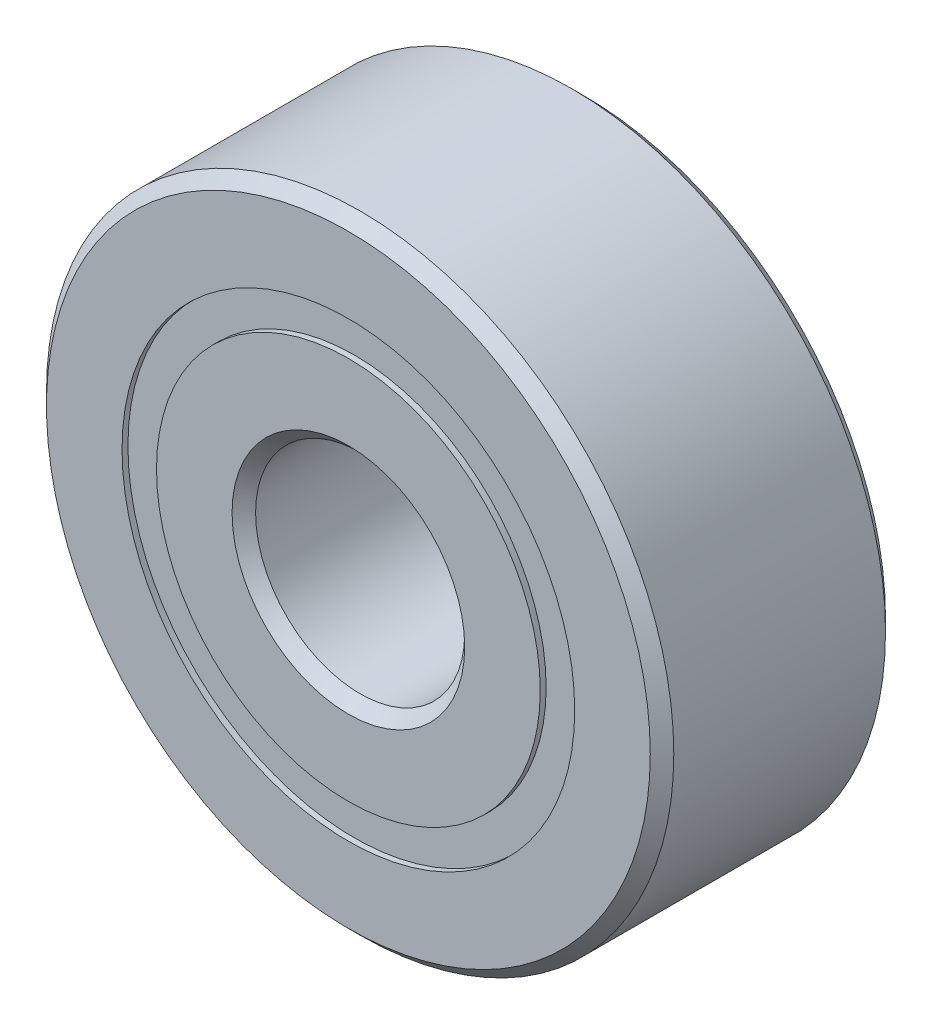
ISO-10303-21;
HEADER;
FILE_DESCRIPTION(('STEP AP214'),'2;1');
FILE_NAME('part.step','',(''),(''),'','','');
FILE_SCHEMA(('AUTOMOTIVE_DESIGN { 1 0 10303 214 1 1 1 1 }'));
ENDSEC;
DATA;
#1=APPLICATION_CONTEXT('core data for automotive mechanical design processes');
#2=APPLICATION_PROTOCOL_DEFINITION('international standard','automotive_design',2000,#1);
#3=PRODUCT_CONTEXT('',#1,'mechanical');
#4=PRODUCT('Part','Part','',(#3));
#5=PRODUCT_RELATED_PRODUCT_CATEGORY('part','',(#4));
#6=PRODUCT_DEFINITION_FORMATION('','',#4);
#7=PRODUCT_DEFINITION_CONTEXT('part definition',#1,'design');
#8=PRODUCT_DEFINITION('design','',#6,#7);
#9=PRODUCT_DEFINITION_SHAPE('','',#8);
#10=(LENGTH_UNIT() NAMED_UNIT(*) SI_UNIT(.MILLI.,.METRE.));
#11=(NAMED_UNIT(*) PLANE_ANGLE_UNIT() SI_UNIT($,.RADIAN.));
#12=(NAMED_UNIT(*) SI_UNIT($,.STERADIAN.) SOLID_ANGLE_UNIT());
#13=UNCERTAINTY_MEASURE_WITH_UNIT(LENGTH_MEASURE(1.E-05),#10,'distance_accuracy_value','');
#14=(GEOMETRIC_REPRESENTATION_CONTEXT(3) GLOBAL_UNCERTAINTY_ASSIGNED_CONTEXT((#13)) GLOBAL_UNIT_ASSIGNED_CONTEXT((#10,
#11,#12)) REPRESENTATION_CONTEXT('',''));
#15=CARTESIAN_POINT('',(0.,0.,0.));
#16=DIRECTION('',(0.,0.,1.));
#17=DIRECTION('',(1.,0.,0.));
#18=AXIS2_PLACEMENT_3D('',#15,#16,#17);
#19=CARTESIAN_POINT('',(0.,6.87335164835165,-3.39328125));
#20=DIRECTION('',(0.,0.,1.));
#21=DIRECTION('',(1.,0.,0.));
#22=AXIS2_PLACEMENT_3D('',#19,#20,#21);
#23=PLANE('',#22);
#24=CARTESIAN_POINT('',(0.,0.,-3.39328125));
#25=DIRECTION('',(0.,0.,1.));
#26=DIRECTION('',(1.,0.,0.));
#27=AXIS2_PLACEMENT_3D('',#24,#25,#26);
#28=CIRCLE('',#27,6.87335164835165);
#29=CARTESIAN_POINT('',(6.87335164835165,0.,-3.39328125));
#30=VERTEX_POINT('',#29);
#31=EDGE_CURVE('E58',#30,#30,#28,.T.);
#32=ORIENTED_EDGE('',*,*,#31,.F.);
#33=EDGE_LOOP('',(#32));
#34=FACE_BOUND('',#33,.T.);
#35=CARTESIAN_POINT('',(0.,0.,-3.39328125));
#36=DIRECTION('',(0.,0.,1.));
#37=DIRECTION('',(1.,0.,0.));
#38=AXIS2_PLACEMENT_3D('',#35,#36,#37);
#39=CIRCLE('',#38,5.82664835164835);
#40=CARTESIAN_POINT('',(5.82664835164835,0.,-3.39328125));
#41=VERTEX_POINT('',#40);
#42=EDGE_CURVE('E11',#41,#41,#39,.T.);
#43=ORIENTED_EDGE('',*,*,#42,.T.);
#44=EDGE_LOOP('',(#43));
#45=FACE_BOUND('',#44,.T.);
#46=ADVANCED_FACE('F44',(#34,#45),#23,.F.);
#47=CARTESIAN_POINT('',(0.,0.,3.571875));
#48=DIRECTION('',(0.,0.,1.));
#49=DIRECTION('',(1.,0.,0.));
#50=AXIS2_PLACEMENT_3D('',#47,#48,#49);
#51=CYLINDRICAL_SURFACE('',#50,5.82664835164835);
#52=ORIENTED_EDGE('',*,*,#42,.F.);
#53=EDGE_LOOP('',(#52));
#54=FACE_BOUND('',#53,.T.);
#55=CARTESIAN_POINT('',(0.,0.,-1.67154216154795));
#56=DIRECTION('',(0.,0.,1.));
#57=DIRECTION('',(1.,0.,0.));
#58=AXIS2_PLACEMENT_3D('',#55,#56,#57);
#59=CIRCLE('',#58,5.82664835164835);
#60=CARTESIAN_POINT('',(5.82664835164835,0.,-1.67154216154795));
#61=VERTEX_POINT('',#60);
#62=EDGE_CURVE('E50',#61,#61,#59,.T.);
#63=ORIENTED_EDGE('',*,*,#62,.T.);
#64=EDGE_LOOP('',(#63));
#65=FACE_BOUND('',#64,.T.);
#66=ADVANCED_FACE('F67',(#54,#65),#51,.F.);
#67=CARTESIAN_POINT('',(0.,6.87335164835165,-1.67154216154795));
#68=DIRECTION('',(0.,0.,-1.));
#69=DIRECTION('',(-1.,0.,0.));
#70=AXIS2_PLACEMENT_3D('',#67,#68,#69);
#71=PLANE('',#70);
#72=ORIENTED_EDGE('',*,*,#62,.F.);
#73=EDGE_LOOP('',(#72));
#74=FACE_BOUND('',#73,.T.);
#75=CARTESIAN_POINT('',(0.,0.,-1.67154216154795));
#76=DIRECTION('',(0.,0.,1.));
#77=DIRECTION('',(1.,0.,0.));
#78=AXIS2_PLACEMENT_3D('',#75,#76,#77);
#79=CIRCLE('',#78,6.87335164835165);
#80=CARTESIAN_POINT('',(6.87335164835165,0.,-1.67154216154795));
#81=VERTEX_POINT('',#80);
#82=EDGE_CURVE('E54',#81,#81,#79,.T.);
#83=ORIENTED_EDGE('',*,*,#82,.T.);
#84=EDGE_LOOP('',(#83));
#85=FACE_BOUND('',#84,.T.);
#86=ADVANCED_FACE('F71',(#74,#85),#71,.F.);
#87=CARTESIAN_POINT('',(0.,0.,3.571875));
#88=DIRECTION('',(0.,0.,1.));
#89=DIRECTION('',(1.,0.,0.));
#90=AXIS2_PLACEMENT_3D('',#87,#88,#89);
#91=CYLINDRICAL_SURFACE('',#90,6.87335164835165);
#92=ORIENTED_EDGE('',*,*,#82,.F.);
#93=EDGE_LOOP('',(#92));
#94=FACE_BOUND('',#93,.T.);
#95=ORIENTED_EDGE('',*,*,#31,.T.);
#96=EDGE_LOOP('',(#95));
#97=FACE_BOUND('',#96,.T.);
#98=ADVANCED_FACE('F64',(#94,#97),#91,.T.);
#99=CLOSED_SHELL('',(#46,#66,#86,#98));
#100=MANIFOLD_SOLID_BREP('B2',#99);
#101=CARTESIAN_POINT('',(0.,6.87335164835165,3.39328125));
#102=DIRECTION('',(0.,0.,-1.));
#103=DIRECTION('',(-1.,0.,0.));
#104=AXIS2_PLACEMENT_3D('',#101,#102,#103);
#105=PLANE('',#104);
#106=CARTESIAN_POINT('',(0.,0.,3.39328125));
#107=DIRECTION('',(0.,0.,1.));
#108=DIRECTION('',(1.,0.,0.));
#109=AXIS2_PLACEMENT_3D('',#106,#107,#108);
#110=CIRCLE('',#109,5.82664835164835);
#111=CARTESIAN_POINT('',(5.82664835164835,0.,3.39328125));
#112=VERTEX_POINT('',#111);
#113=EDGE_CURVE('E43',#112,#112,#110,.T.);
#114=ORIENTED_EDGE('',*,*,#113,.F.);
#115=EDGE_LOOP('',(#114));
#116=FACE_BOUND('',#115,.T.);
#117=CARTESIAN_POINT('',(0.,0.,3.39328125));
#118=DIRECTION('',(0.,0.,1.));
#119=DIRECTION('',(1.,0.,0.));
#120=AXIS2_PLACEMENT_3D('',#117,#118,#119);
#121=CIRCLE('',#120,6.87335164835165);
#122=CARTESIAN_POINT('',(6.87335164835165,0.,3.39328125));
#123=VERTEX_POINT('',#122);
#124=EDGE_CURVE('E126',#123,#123,#121,.T.);
#125=ORIENTED_EDGE('',*,*,#124,.T.);
#126=EDGE_LOOP('',(#125));
#127=FACE_BOUND('',#126,.T.);
#128=ADVANCED_FACE('F112',(#116,#127),#105,.F.);
#129=CARTESIAN_POINT('',(0.,0.,3.571875));
#130=DIRECTION('',(0.,0.,1.));
#131=DIRECTION('',(1.,0.,0.));
#132=AXIS2_PLACEMENT_3D('',#129,#130,#131);
#133=CYLINDRICAL_SURFACE('',#132,5.82664835164835);
#134=CARTESIAN_POINT('',(0.,0.,1.67154216154795));
#135=DIRECTION('',(0.,0.,1.));
#136=DIRECTION('',(1.,0.,0.));
#137=AXIS2_PLACEMENT_3D('',#134,#135,#136);
#138=CIRCLE('',#137,5.82664835164835);
#139=CARTESIAN_POINT('',(5.82664835164835,0.,1.67154216154795));
#140=VERTEX_POINT('',#139);
#141=EDGE_CURVE('E118',#140,#140,#138,.T.);
#142=ORIENTED_EDGE('',*,*,#141,.F.);
#143=EDGE_LOOP('',(#142));
#144=FACE_BOUND('',#143,.T.);
#145=ORIENTED_EDGE('',*,*,#113,.T.);
#146=EDGE_LOOP('',(#145));
#147=FACE_BOUND('',#146,.T.);
#148=ADVANCED_FACE('F141',(#144,#147),#133,.F.);
#149=CARTESIAN_POINT('',(0.,6.87335164835165,1.67154216154795));
#150=DIRECTION('',(0.,0.,1.));
#151=DIRECTION('',(1.,0.,0.));
#152=AXIS2_PLACEMENT_3D('',#149,#150,#151);
#153=PLANE('',#152);
#154=CARTESIAN_POINT('',(0.,0.,1.67154216154795));
#155=DIRECTION('',(0.,0.,1.));
#156=DIRECTION('',(1.,0.,0.));
#157=AXIS2_PLACEMENT_3D('',#154,#155,#156);
#158=CIRCLE('',#157,6.87335164835165);
#159=CARTESIAN_POINT('',(6.87335164835165,0.,1.67154216154795));
#160=VERTEX_POINT('',#159);
#161=EDGE_CURVE('E122',#160,#160,#158,.T.);
#162=ORIENTED_EDGE('',*,*,#161,.F.);
#163=EDGE_LOOP('',(#162));
#164=FACE_BOUND('',#163,.T.);
#165=ORIENTED_EDGE('',*,*,#141,.T.);
#166=EDGE_LOOP('',(#165));
#167=FACE_BOUND('',#166,.T.);
#168=ADVANCED_FACE('F136',(#164,#167),#153,.F.);
#169=CARTESIAN_POINT('',(0.,0.,3.571875));
#170=DIRECTION('',(0.,0.,1.));
#171=DIRECTION('',(1.,0.,0.));
#172=AXIS2_PLACEMENT_3D('',#169,#170,#171);
#173=CYLINDRICAL_SURFACE('',#172,6.87335164835165);
#174=ORIENTED_EDGE('',*,*,#124,.F.);
#175=EDGE_LOOP('',(#174));
#176=FACE_BOUND('',#175,.T.);
#177=ORIENTED_EDGE('',*,*,#161,.T.);
#178=EDGE_LOOP('',(#177));
#179=FACE_BOUND('',#178,.T.);
#180=ADVANCED_FACE('F133',(#176,#179),#173,.T.);
#181=CLOSED_SHELL('',(#128,#148,#168,#180));
#182=MANIFOLD_SOLID_BREP('B6',#181);
#183=CARTESIAN_POINT('',(-4.49012806053452,4.49012806053463,0.));
#184=DIRECTION('',(0.,0.,1.));
#185=DIRECTION('',(-0.707106781186539,0.707106781186556,0.));
#186=AXIS2_PLACEMENT_3D('',#183,#184,#185);
#187=SPHERICAL_SURFACE('',#186,1.67154216154795);
#188=CARTESIAN_POINT('',(-4.49012806053452,4.49012806053463,1.67154216154795));
#189=VERTEX_POINT('',#188);
#190=VERTEX_LOOP('',#189);
#191=FACE_BOUND('',#190,.T.);
#192=ADVANCED_FACE('F179',(#191),#187,.T.);
#193=CLOSED_SHELL('',(#192));
#194=MANIFOLD_SOLID_BREP('B38',#193);
#195=CARTESIAN_POINT('',(-6.35,0.,0.));
#196=DIRECTION('',(0.,0.,1.));
#197=DIRECTION('',(-1.,0.,0.));
#198=AXIS2_PLACEMENT_3D('',#195,#196,#197);
#199=SPHERICAL_SURFACE('',#198,1.67154216154795);
#200=CARTESIAN_POINT('',(-6.35,0.,1.67154216154795));
#201=VERTEX_POINT('',#200);
#202=VERTEX_LOOP('',#201);
#203=FACE_BOUND('',#202,.T.);
#204=ADVANCED_FACE('F199',(#203),#199,.T.);
#205=CLOSED_SHELL('',(#204));
#206=MANIFOLD_SOLID_BREP('B108',#205);
#207=CARTESIAN_POINT('',(-4.49012806053462,-4.49012806053454,0.));
#208=DIRECTION('',(0.,0.,1.));
#209=DIRECTION('',(-0.707106781186554,-0.707106781186541,0.));
#210=AXIS2_PLACEMENT_3D('',#207,#208,#209);
#211=SPHERICAL_SURFACE('',#210,1.67154216154795);
#212=CARTESIAN_POINT('',(-4.49012806053462,-4.49012806053454,1.67154216154795));
#213=VERTEX_POINT('',#212);
#214=VERTEX_LOOP('',#213);
#215=FACE_BOUND('',#214,.T.);
#216=ADVANCED_FACE('F219',(#215),#211,.T.);
#217=CLOSED_SHELL('',(#216));
#218=MANIFOLD_SOLID_BREP('B175',#217);
#219=CARTESIAN_POINT('',(0.,-6.35,0.));
#220=DIRECTION('',(0.,0.,1.));
#221=DIRECTION('',(0.,-1.,0.));
#222=AXIS2_PLACEMENT_3D('',#219,#220,#221);
#223=SPHERICAL_SURFACE('',#222,1.67154216154795);
#224=CARTESIAN_POINT('',(0.,-6.35,1.67154216154795));
#225=VERTEX_POINT('',#224);
#226=VERTEX_LOOP('',#225);
#227=FACE_BOUND('',#226,.T.);
#228=ADVANCED_FACE('F239',(#227),#223,.T.);
#229=CLOSED_SHELL('',(#228));
#230=MANIFOLD_SOLID_BREP('B195',#229);
#231=CARTESIAN_POINT('',(4.49012806053455,-4.4901280605346,0.));
#232=DIRECTION('',(0.,0.,1.));
#233=DIRECTION('',(0.707106781186544,-0.707106781186551,0.));
#234=AXIS2_PLACEMENT_3D('',#231,#232,#233);
#235=SPHERICAL_SURFACE('',#234,1.67154216154795);
#236=CARTESIAN_POINT('',(4.49012806053455,-4.4901280605346,1.67154216154795));
#237=VERTEX_POINT('',#236);
#238=VERTEX_LOOP('',#237);
#239=FACE_BOUND('',#238,.T.);
#240=ADVANCED_FACE('F259',(#239),#235,.T.);
#241=CLOSED_SHELL('',(#240));
#242=MANIFOLD_SOLID_BREP('B215',#241);
#243=CARTESIAN_POINT('',(6.35,0.,0.));
#244=DIRECTION('',(0.,0.,1.));
#245=DIRECTION('',(1.,0.,0.));
#246=AXIS2_PLACEMENT_3D('',#243,#244,#245);
#247=SPHERICAL_SURFACE('',#246,1.67154216154795);
#248=CARTESIAN_POINT('',(6.35,0.,1.67154216154795));
#249=VERTEX_POINT('',#248);
#250=VERTEX_LOOP('',#249);
#251=FACE_BOUND('',#250,.T.);
#252=ADVANCED_FACE('F279',(#251),#247,.T.);
#253=CLOSED_SHELL('',(#252));
#254=MANIFOLD_SOLID_BREP('B235',#253);
#255=CARTESIAN_POINT('',(4.49012806053458,4.49012806053457,0.));
#256=DIRECTION('',(0.,0.,1.));
#257=DIRECTION('',(0.707106781186549,0.707106781186546,0.));
#258=AXIS2_PLACEMENT_3D('',#255,#256,#257);
#259=SPHERICAL_SURFACE('',#258,1.67154216154795);
#260=CARTESIAN_POINT('',(4.49012806053458,4.49012806053457,1.67154216154795));
#261=VERTEX_POINT('',#260);
#262=VERTEX_LOOP('',#261);
#263=FACE_BOUND('',#262,.T.);
#264=ADVANCED_FACE('F299',(#263),#259,.T.);
#265=CLOSED_SHELL('',(#264));
#266=MANIFOLD_SOLID_BREP('B255',#265);
#267=CARTESIAN_POINT('',(0.,6.35,0.));
#268=DIRECTION('',(0.,0.,1.));
#269=DIRECTION('',(0.,1.,0.));
#270=AXIS2_PLACEMENT_3D('',#267,#268,#269);
#271=SPHERICAL_SURFACE('',#270,1.67154216154795);
#272=CARTESIAN_POINT('',(0.,6.35,1.67154216154795));
#273=VERTEX_POINT('',#272);
#274=VERTEX_LOOP('',#273);
#275=FACE_BOUND('',#274,.T.);
#276=ADVANCED_FACE('F322',(#275),#271,.T.);
#277=CLOSED_SHELL('',(#276));
#278=MANIFOLD_SOLID_BREP('B275',#277);
#279=CARTESIAN_POINT('',(0.,5.82664835164835,3.571875));
#280=DIRECTION('',(0.,0.,-1.));
#281=DIRECTION('',(-1.,0.,0.));
#282=AXIS2_PLACEMENT_3D('',#279,#280,#281);
#283=PLANE('',#282);
#284=CARTESIAN_POINT('',(0.,0.,3.571875));
#285=DIRECTION('',(0.,0.,1.));
#286=DIRECTION('',(1.,0.,0.));
#287=AXIS2_PLACEMENT_3D('',#284,#285,#286);
#288=CIRCLE('',#287,3.5321875);
#289=CARTESIAN_POINT('',(3.5321875,0.,3.571875));
#290=VERTEX_POINT('',#289);
#291=EDGE_CURVE('E370',#290,#290,#288,.T.);
#292=ORIENTED_EDGE('',*,*,#291,.F.);
#293=EDGE_LOOP('',(#292));
#294=FACE_BOUND('',#293,.T.);
#295=CARTESIAN_POINT('',(0.,0.,3.571875));
#296=DIRECTION('',(0.,0.,1.));
#297=DIRECTION('',(1.,0.,0.));
#298=AXIS2_PLACEMENT_3D('',#295,#296,#297);
#299=CIRCLE('',#298,5.82664835164835);
#300=CARTESIAN_POINT('',(5.82664835164835,0.,3.571875));
#301=VERTEX_POINT('',#300);
#302=EDGE_CURVE('E321',#301,#301,#299,.T.);
#303=ORIENTED_EDGE('',*,*,#302,.T.);
#304=EDGE_LOOP('',(#303));
#305=FACE_BOUND('',#304,.T.);
#306=ADVANCED_FACE('F342',(#294,#305),#283,.F.);
#307=CARTESIAN_POINT('',(0.,0.,3.571875));
#308=DIRECTION('',(0.,0.,1.));
#309=DIRECTION('',(1.,0.,0.));
#310=AXIS2_PLACEMENT_3D('',#307,#308,#309);
#311=CYLINDRICAL_SURFACE('',#310,5.82664835164835);
#312=ORIENTED_EDGE('',*,*,#302,.F.);
#313=EDGE_LOOP('',(#312));
#314=FACE_BOUND('',#313,.T.);
#315=CARTESIAN_POINT('',(0.,0.,1.5875));
#316=DIRECTION('',(0.,0.,1.));
#317=DIRECTION('',(1.,0.,0.));
#318=AXIS2_PLACEMENT_3D('',#315,#316,#317);
#319=CIRCLE('',#318,5.82664835164835);
#320=CARTESIAN_POINT('',(5.82664835164835,0.,1.5875));
#321=VERTEX_POINT('',#320);
#322=EDGE_CURVE('E348',#321,#321,#319,.T.);
#323=ORIENTED_EDGE('',*,*,#322,.T.);
#324=EDGE_LOOP('',(#323));
#325=FACE_BOUND('',#324,.T.);
#326=ADVANCED_FACE('F377',(#314,#325),#311,.T.);
#327=CARTESIAN_POINT('',(0.,0.,0.));
#328=DIRECTION('',(0.,0.,1.));
#329=DIRECTION('',(1.,0.,0.));
#330=AXIS2_PLACEMENT_3D('',#327,#328,#329);
#331=TOROIDAL_SURFACE('',#330,6.35,1.67154216154795);
#332=ORIENTED_EDGE('',*,*,#322,.F.);
#333=EDGE_LOOP('',(#332));
#334=FACE_BOUND('',#333,.T.);
#335=CARTESIAN_POINT('',(0.,0.,-1.5875));
#336=DIRECTION('',(0.,0.,1.));
#337=DIRECTION('',(1.,0.,0.));
#338=AXIS2_PLACEMENT_3D('',#335,#336,#337);
#339=CIRCLE('',#338,5.82664835164835);
#340=CARTESIAN_POINT('',(5.82664835164835,0.,-1.5875));
#341=VERTEX_POINT('',#340);
#342=EDGE_CURVE('E352',#341,#341,#339,.T.);
#343=ORIENTED_EDGE('',*,*,#342,.T.);
#344=EDGE_LOOP('',(#343));
#345=FACE_BOUND('',#344,.T.);
#346=ADVANCED_FACE('F381',(#334,#345),#331,.F.);
#347=CARTESIAN_POINT('',(0.,0.,3.571875));
#348=DIRECTION('',(0.,0.,1.));
#349=DIRECTION('',(1.,0.,0.));
#350=AXIS2_PLACEMENT_3D('',#347,#348,#349);
#351=CYLINDRICAL_SURFACE('',#350,5.82664835164835);
#352=ORIENTED_EDGE('',*,*,#342,.F.);
#353=EDGE_LOOP('',(#352));
#354=FACE_BOUND('',#353,.T.);
#355=CARTESIAN_POINT('',(0.,0.,-3.571875));
#356=DIRECTION('',(0.,0.,1.));
#357=DIRECTION('',(1.,0.,0.));
#358=AXIS2_PLACEMENT_3D('',#355,#356,#357);
#359=CIRCLE('',#358,5.82664835164835);
#360=CARTESIAN_POINT('',(5.82664835164835,0.,-3.571875));
#361=VERTEX_POINT('',#360);
#362=EDGE_CURVE('E356',#361,#361,#359,.T.);
#363=ORIENTED_EDGE('',*,*,#362,.T.);
#364=EDGE_LOOP('',(#363));
#365=FACE_BOUND('',#364,.T.);
#366=ADVANCED_FACE('F386',(#354,#365),#351,.T.);
#367=CARTESIAN_POINT('',(0.,3.5321875,-3.571875));
#368=DIRECTION('',(0.,0.,1.));
#369=DIRECTION('',(1.,0.,0.));
#370=AXIS2_PLACEMENT_3D('',#367,#368,#369);
#371=PLANE('',#370);
#372=ORIENTED_EDGE('',*,*,#362,.F.);
#373=EDGE_LOOP('',(#372));
#374=FACE_BOUND('',#373,.T.);
#375=CARTESIAN_POINT('',(0.,0.,-3.571875));
#376=DIRECTION('',(0.,0.,1.));
#377=DIRECTION('',(1.,0.,0.));
#378=AXIS2_PLACEMENT_3D('',#375,#376,#377);
#379=CIRCLE('',#378,3.5321875);
#380=CARTESIAN_POINT('',(3.5321875,0.,-3.571875));
#381=VERTEX_POINT('',#380);
#382=EDGE_CURVE('E361',#381,#381,#379,.T.);
#383=ORIENTED_EDGE('',*,*,#382,.T.);
#384=EDGE_LOOP('',(#383));
#385=FACE_BOUND('',#384,.T.);
#386=ADVANCED_FACE('F392',(#374,#385),#371,.F.);
#387=CARTESIAN_POINT('',(0.,0.,-3.2146875));
#388=DIRECTION('',(0.,0.,-1.));
#389=DIRECTION('',(-1.,0.,0.));
#390=AXIS2_PLACEMENT_3D('',#387,#388,#389);
#391=CONICAL_SURFACE('',#390,3.175,0.785398163397444);
#392=ORIENTED_EDGE('',*,*,#382,.F.);
#393=EDGE_LOOP('',(#392));
#394=FACE_BOUND('',#393,.T.);
#395=CARTESIAN_POINT('',(0.,0.,-3.2146875));
#396=DIRECTION('',(0.,0.,1.));
#397=DIRECTION('',(1.,0.,0.));
#398=AXIS2_PLACEMENT_3D('',#395,#396,#397);
#399=CIRCLE('',#398,3.175);
#400=CARTESIAN_POINT('',(3.175,0.,-3.2146875));
#401=VERTEX_POINT('',#400);
#402=EDGE_CURVE('E364',#401,#401,#399,.T.);
#403=ORIENTED_EDGE('',*,*,#402,.T.);
#404=EDGE_LOOP('',(#403));
#405=FACE_BOUND('',#404,.T.);
#406=ADVANCED_FACE('F396',(#394,#405),#391,.F.);
#407=CARTESIAN_POINT('',(0.,0.,3.571875));
#408=DIRECTION('',(0.,0.,1.));
#409=DIRECTION('',(1.,0.,0.));
#410=AXIS2_PLACEMENT_3D('',#407,#408,#409);
#411=CYLINDRICAL_SURFACE('',#410,3.175);
#412=ORIENTED_EDGE('',*,*,#402,.F.);
#413=EDGE_LOOP('',(#412));
#414=FACE_BOUND('',#413,.T.);
#415=CARTESIAN_POINT('',(0.,0.,3.2146875));
#416=DIRECTION('',(0.,0.,1.));
#417=DIRECTION('',(1.,0.,0.));
#418=AXIS2_PLACEMENT_3D('',#415,#416,#417);
#419=CIRCLE('',#418,3.175);
#420=CARTESIAN_POINT('',(3.175,0.,3.2146875));
#421=VERTEX_POINT('',#420);
#422=EDGE_CURVE('E367',#421,#421,#419,.T.);
#423=ORIENTED_EDGE('',*,*,#422,.T.);
#424=EDGE_LOOP('',(#423));
#425=FACE_BOUND('',#424,.T.);
#426=ADVANCED_FACE('F400',(#414,#425),#411,.F.);
#427=CARTESIAN_POINT('',(0.,0.,3.571875));
#428=DIRECTION('',(0.,0.,1.));
#429=DIRECTION('',(1.,0.,0.));
#430=AXIS2_PLACEMENT_3D('',#427,#428,#429);
#431=CONICAL_SURFACE('',#430,3.5321875,0.785398163397454);
#432=ORIENTED_EDGE('',*,*,#422,.F.);
#433=EDGE_LOOP('',(#432));
#434=FACE_BOUND('',#433,.T.);
#435=ORIENTED_EDGE('',*,*,#291,.T.);
#436=EDGE_LOOP('',(#435));
#437=FACE_BOUND('',#436,.T.);
#438=ADVANCED_FACE('F374',(#434,#437),#431,.F.);
#439=CLOSED_SHELL('',(#306,#326,#346,#366,#386,#406,#426,#438));
#440=MANIFOLD_SOLID_BREP('B295',#439);
#441=CARTESIAN_POINT('',(0.,0.,3.2146875));
#442=DIRECTION('',(0.,0.,-1.));
#443=DIRECTION('',(-1.,0.,0.));
#444=AXIS2_PLACEMENT_3D('',#441,#442,#443);
#445=CONICAL_SURFACE('',#444,9.525,0.785398163397448);
#446=CARTESIAN_POINT('',(0.,0.,3.571875));
#447=DIRECTION('',(0.,0.,1.));
#448=DIRECTION('',(1.,0.,0.));
#449=AXIS2_PLACEMENT_3D('',#446,#447,#448);
#450=CIRCLE('',#449,9.1678125);
#451=CARTESIAN_POINT('',(9.1678125,0.,3.571875));
#452=VERTEX_POINT('',#451);
#453=EDGE_CURVE('E492',#452,#452,#450,.T.);
#454=ORIENTED_EDGE('',*,*,#453,.F.);
#455=EDGE_LOOP('',(#454));
#456=FACE_BOUND('',#455,.T.);
#457=CARTESIAN_POINT('',(0.,0.,3.2146875));
#458=DIRECTION('',(0.,0.,1.));
#459=DIRECTION('',(1.,0.,0.));
#460=AXIS2_PLACEMENT_3D('',#457,#458,#459);
#461=CIRCLE('',#460,9.525);
#462=CARTESIAN_POINT('',(9.525,0.,3.2146875));
#463=VERTEX_POINT('',#462);
#464=EDGE_CURVE('E341',#463,#463,#461,.T.);
#465=ORIENTED_EDGE('',*,*,#464,.T.);
#466=EDGE_LOOP('',(#465));
#467=FACE_BOUND('',#466,.T.);
#468=ADVANCED_FACE('F464',(#456,#467),#445,.T.);
#469=CARTESIAN_POINT('',(0.,0.,3.571875));
#470=DIRECTION('',(0.,0.,1.));
#471=DIRECTION('',(1.,0.,0.));
#472=AXIS2_PLACEMENT_3D('',#469,#470,#471);
#473=CYLINDRICAL_SURFACE('',#472,9.525);
#474=ORIENTED_EDGE('',*,*,#464,.F.);
#475=EDGE_LOOP('',(#474));
#476=FACE_BOUND('',#475,.T.);
#477=CARTESIAN_POINT('',(0.,0.,-3.2146875));
#478=DIRECTION('',(0.,0.,1.));
#479=DIRECTION('',(1.,0.,0.));
#480=AXIS2_PLACEMENT_3D('',#477,#478,#479);
#481=CIRCLE('',#480,9.525);
#482=CARTESIAN_POINT('',(9.525,0.,-3.2146875));
#483=VERTEX_POINT('',#482);
#484=EDGE_CURVE('E470',#483,#483,#481,.T.);
#485=ORIENTED_EDGE('',*,*,#484,.T.);
#486=EDGE_LOOP('',(#485));
#487=FACE_BOUND('',#486,.T.);
#488=ADVANCED_FACE('F499',(#476,#487),#473,.T.);
#489=CARTESIAN_POINT('',(0.,0.,-3.571875));
#490=DIRECTION('',(0.,0.,1.));
#491=DIRECTION('',(1.,0.,0.));
#492=AXIS2_PLACEMENT_3D('',#489,#490,#491);
#493=CONICAL_SURFACE('',#492,9.1678125,0.785398163397445);
#494=ORIENTED_EDGE('',*,*,#484,.F.);
#495=EDGE_LOOP('',(#494));
#496=FACE_BOUND('',#495,.T.);
#497=CARTESIAN_POINT('',(0.,0.,-3.571875));
#498=DIRECTION('',(0.,0.,1.));
#499=DIRECTION('',(1.,0.,0.));
#500=AXIS2_PLACEMENT_3D('',#497,#498,#499);
#501=CIRCLE('',#500,9.1678125);
#502=CARTESIAN_POINT('',(9.1678125,0.,-3.571875));
#503=VERTEX_POINT('',#502);
#504=EDGE_CURVE('E474',#503,#503,#501,.T.);
#505=ORIENTED_EDGE('',*,*,#504,.T.);
#506=EDGE_LOOP('',(#505));
#507=FACE_BOUND('',#506,.T.);
#508=ADVANCED_FACE('F503',(#496,#507),#493,.T.);
#509=CARTESIAN_POINT('',(0.,9.1678125,-3.571875));
#510=DIRECTION('',(0.,0.,1.));
#511=DIRECTION('',(1.,0.,0.));
#512=AXIS2_PLACEMENT_3D('',#509,#510,#511);
#513=PLANE('',#512);
#514=ORIENTED_EDGE('',*,*,#504,.F.);
#515=EDGE_LOOP('',(#514));
#516=FACE_BOUND('',#515,.T.);
#517=CARTESIAN_POINT('',(0.,0.,-3.571875));
#518=DIRECTION('',(0.,0.,1.));
#519=DIRECTION('',(1.,0.,0.));
#520=AXIS2_PLACEMENT_3D('',#517,#518,#519);
#521=CIRCLE('',#520,6.87335164835165);
#522=CARTESIAN_POINT('',(6.87335164835165,0.,-3.571875));
#523=VERTEX_POINT('',#522);
#524=EDGE_CURVE('E478',#523,#523,#521,.T.);
#525=ORIENTED_EDGE('',*,*,#524,.T.);
#526=EDGE_LOOP('',(#525));
#527=FACE_BOUND('',#526,.T.);
#528=ADVANCED_FACE('F508',(#516,#527),#513,.F.);
#529=CARTESIAN_POINT('',(0.,0.,3.571875));
#530=DIRECTION('',(0.,0.,1.));
#531=DIRECTION('',(1.,0.,0.));
#532=AXIS2_PLACEMENT_3D('',#529,#530,#531);
#533=CYLINDRICAL_SURFACE('',#532,6.87335164835165);
#534=ORIENTED_EDGE('',*,*,#524,.F.);
#535=EDGE_LOOP('',(#534));
#536=FACE_BOUND('',#535,.T.);
#537=CARTESIAN_POINT('',(0.,0.,-1.5875));
#538=DIRECTION('',(0.,0.,1.));
#539=DIRECTION('',(1.,0.,0.));
#540=AXIS2_PLACEMENT_3D('',#537,#538,#539);
#541=CIRCLE('',#540,6.87335164835165);
#542=CARTESIAN_POINT('',(6.87335164835165,0.,-1.5875));
#543=VERTEX_POINT('',#542);
#544=EDGE_CURVE('E483',#543,#543,#541,.T.);
#545=ORIENTED_EDGE('',*,*,#544,.T.);
#546=EDGE_LOOP('',(#545));
#547=FACE_BOUND('',#546,.T.);
#548=ADVANCED_FACE('F514',(#536,#547),#533,.F.);
#549=CARTESIAN_POINT('',(0.,0.,0.));
#550=DIRECTION('',(0.,0.,1.));
#551=DIRECTION('',(1.,0.,0.));
#552=AXIS2_PLACEMENT_3D('',#549,#550,#551);
#553=TOROIDAL_SURFACE('',#552,6.35,1.67154216154795);
#554=ORIENTED_EDGE('',*,*,#544,.F.);
#555=EDGE_LOOP('',(#554));
#556=FACE_BOUND('',#555,.T.);
#557=CARTESIAN_POINT('',(0.,0.,1.5875));
#558=DIRECTION('',(0.,0.,1.));
#559=DIRECTION('',(1.,0.,0.));
#560=AXIS2_PLACEMENT_3D('',#557,#558,#559);
#561=CIRCLE('',#560,6.87335164835165);
#562=CARTESIAN_POINT('',(6.87335164835165,0.,1.5875));
#563=VERTEX_POINT('',#562);
#564=EDGE_CURVE('E486',#563,#563,#561,.T.);
#565=ORIENTED_EDGE('',*,*,#564,.T.);
#566=EDGE_LOOP('',(#565));
#567=FACE_BOUND('',#566,.T.);
#568=ADVANCED_FACE('F518',(#556,#567),#553,.F.);
#569=CARTESIAN_POINT('',(0.,0.,3.571875));
#570=DIRECTION('',(0.,0.,1.));
#571=DIRECTION('',(1.,0.,0.));
#572=AXIS2_PLACEMENT_3D('',#569,#570,#571);
#573=CYLINDRICAL_SURFACE('',#572,6.87335164835165);
#574=ORIENTED_EDGE('',*,*,#564,.F.);
#575=EDGE_LOOP('',(#574));
#576=FACE_BOUND('',#575,.T.);
#577=CARTESIAN_POINT('',(0.,0.,3.571875));
#578=DIRECTION('',(0.,0.,1.));
#579=DIRECTION('',(1.,0.,0.));
#580=AXIS2_PLACEMENT_3D('',#577,#578,#579);
#581=CIRCLE('',#580,6.87335164835165);
#582=CARTESIAN_POINT('',(6.87335164835165,0.,3.571875));
#583=VERTEX_POINT('',#582);
#584=EDGE_CURVE('E489',#583,#583,#581,.T.);
#585=ORIENTED_EDGE('',*,*,#584,.T.);
#586=EDGE_LOOP('',(#585));
#587=FACE_BOUND('',#586,.T.);
#588=ADVANCED_FACE('F522',(#576,#587),#573,.F.);
#589=CARTESIAN_POINT('',(0.,9.1678125,3.571875));
#590=DIRECTION('',(0.,0.,-1.));
#591=DIRECTION('',(-1.,0.,0.));
#592=AXIS2_PLACEMENT_3D('',#589,#590,#591);
#593=PLANE('',#592);
#594=ORIENTED_EDGE('',*,*,#584,.F.);
#595=EDGE_LOOP('',(#594));
#596=FACE_BOUND('',#595,.T.);
#597=ORIENTED_EDGE('',*,*,#453,.T.);
#598=EDGE_LOOP('',(#597));
#599=FACE_BOUND('',#598,.T.);
#600=ADVANCED_FACE('F496',(#596,#599),#593,.F.);
#601=CLOSED_SHELL('',(#468,#488,#508,#528,#548,#568,#588,#600));
#602=MANIFOLD_SOLID_BREP('B316',#601);
#603=ADVANCED_BREP_SHAPE_REPRESENTATION('',(#18,#100,#182,#194,#206,#218,#230,#242,#254,#266,
#278,#440,#602),#14);
#604=SHAPE_DEFINITION_REPRESENTATION(#9,#603);
ENDSEC;
END-ISO-10303-21;
